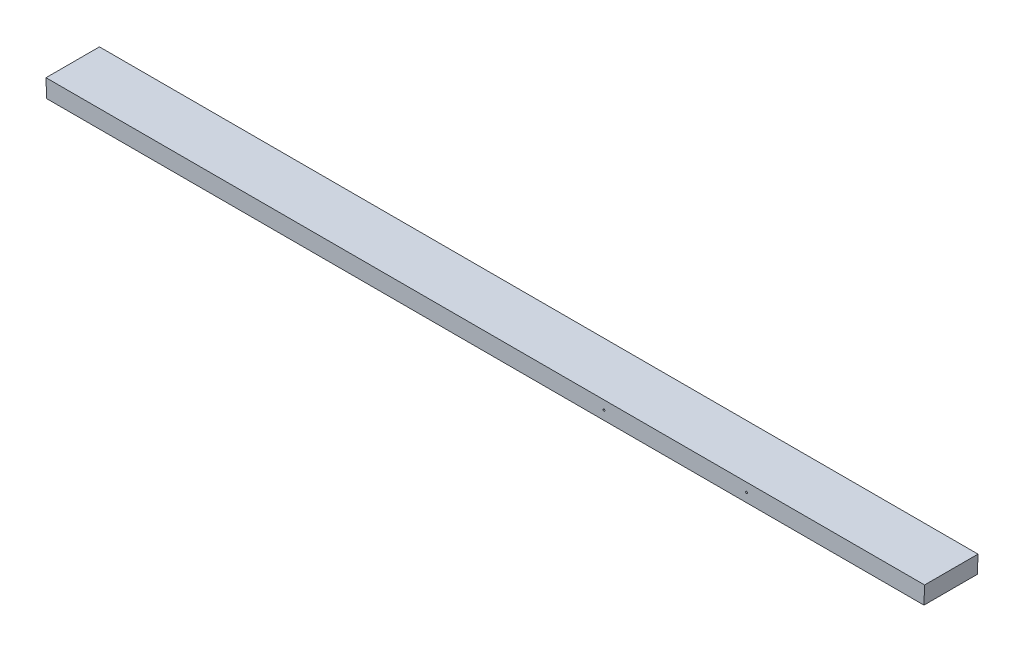
ISO-10303-21;
HEADER;
FILE_DESCRIPTION(('STEP AP214'),'2;1');
FILE_NAME('part.step','',(''),(''),'','','');
FILE_SCHEMA(('AUTOMOTIVE_DESIGN { 1 0 10303 214 1 1 1 1 }'));
ENDSEC;
DATA;
#1=APPLICATION_CONTEXT('core data for automotive mechanical design processes');
#2=APPLICATION_PROTOCOL_DEFINITION('international standard','automotive_design',2000,#1);
#3=PRODUCT_CONTEXT('',#1,'mechanical');
#4=PRODUCT('Part','Part','',(#3));
#5=PRODUCT_RELATED_PRODUCT_CATEGORY('part','',(#4));
#6=PRODUCT_DEFINITION_FORMATION('','',#4);
#7=PRODUCT_DEFINITION_CONTEXT('part definition',#1,'design');
#8=PRODUCT_DEFINITION('design','',#6,#7);
#9=PRODUCT_DEFINITION_SHAPE('','',#8);
#10=(LENGTH_UNIT() NAMED_UNIT(*) SI_UNIT(.MILLI.,.METRE.));
#11=(NAMED_UNIT(*) PLANE_ANGLE_UNIT() SI_UNIT($,.RADIAN.));
#12=(NAMED_UNIT(*) SI_UNIT($,.STERADIAN.) SOLID_ANGLE_UNIT());
#13=UNCERTAINTY_MEASURE_WITH_UNIT(LENGTH_MEASURE(1.E-05),#10,'distance_accuracy_value','');
#14=(GEOMETRIC_REPRESENTATION_CONTEXT(3) GLOBAL_UNCERTAINTY_ASSIGNED_CONTEXT((#13)) GLOBAL_UNIT_ASSIGNED_CONTEXT((#10,
#11,#12)) REPRESENTATION_CONTEXT('',''));
#15=CARTESIAN_POINT('',(0.,0.,0.));
#16=DIRECTION('',(0.,0.,1.));
#17=DIRECTION('',(1.,0.,0.));
#18=AXIS2_PLACEMENT_3D('',#15,#16,#17);
#19=CARTESIAN_POINT('',(-469.231738923997,5916.9300001442,2683.51));
#20=DIRECTION('',(0.,-1.,0.));
#21=DIRECTION('',(0.,0.,-1.));
#22=AXIS2_PLACEMENT_3D('',#19,#20,#21);
#23=PLANE('',#22);
#24=DIRECTION('',(1.,0.,0.));
#25=VECTOR('',#24,1.);
#26=CARTESIAN_POINT('',(2.98372437868011E-13,5916.9300001442,2683.51));
#27=LINE('',#26,#25);
#28=CARTESIAN_POINT('',(-469.231738923997,5916.9300001442,2683.51));
#29=VERTEX_POINT('',#28);
#30=CARTESIAN_POINT('',(469.231738923998,5916.9300001442,2683.51));
#31=VERTEX_POINT('',#30);
#32=EDGE_CURVE('E171',#29,#31,#27,.T.);
#33=ORIENTED_EDGE('',*,*,#32,.T.);
#34=DIRECTION('',(0.,0.,1.));
#35=VECTOR('',#34,1.);
#36=CARTESIAN_POINT('',(469.231738923998,5916.9300001442,2683.51));
#37=LINE('',#36,#35);
#38=CARTESIAN_POINT('',(469.231738923998,5916.9300001442,2740.66));
#39=VERTEX_POINT('',#38);
#40=EDGE_CURVE('E93',#39,#31,#37,.F.);
#41=ORIENTED_EDGE('',*,*,#40,.F.);
#42=DIRECTION('',(-1.,0.,0.));
#43=VECTOR('',#42,1.);
#44=CARTESIAN_POINT('',(-1.08246744900953E-12,5916.9300001442,2740.66));
#45=LINE('',#44,#43);
#46=CARTESIAN_POINT('',(-469.231738923997,5916.9300001442,2740.66));
#47=VERTEX_POINT('',#46);
#48=EDGE_CURVE('E98',#39,#47,#45,.T.);
#49=ORIENTED_EDGE('',*,*,#48,.T.);
#50=DIRECTION('',(0.,0.,1.));
#51=VECTOR('',#50,1.);
#52=CARTESIAN_POINT('',(-469.231738923999,5916.9300001442,2683.51));
#53=LINE('',#52,#51);
#54=EDGE_CURVE('E164',#29,#47,#53,.T.);
#55=ORIENTED_EDGE('',*,*,#54,.F.);
#56=EDGE_LOOP('',(#33,#41,#49,#55));
#57=FACE_BOUND('',#56,.T.);
#58=ADVANCED_FACE('F52',(#57),#23,.T.);
#59=CARTESIAN_POINT('',(0.,5926.4550001442,2740.66));
#60=DIRECTION('',(0.,0.,-1.));
#61=DIRECTION('',(-1.,0.,0.));
#62=AXIS2_PLACEMENT_3D('',#59,#60,#61);
#63=PLANE('',#62);
#64=CARTESIAN_POINT('',(127.000000000001,5926.4550001442,2740.66));
#65=DIRECTION('',(0.,0.,-1.));
#66=DIRECTION('',(-1.,0.,0.));
#67=AXIS2_PLACEMENT_3D('',#64,#65,#66);
#68=CIRCLE('',#67,0.991870000000006);
#69=CARTESIAN_POINT('',(126.008130000001,5926.4550001442,2740.66));
#70=VERTEX_POINT('',#69);
#71=EDGE_CURVE('E55',#70,#70,#68,.T.);
#72=ORIENTED_EDGE('',*,*,#71,.T.);
#73=EDGE_LOOP('',(#72));
#74=FACE_BOUND('',#73,.T.);
#75=CARTESIAN_POINT('',(279.400000000001,5926.4550001442,2740.66));
#76=DIRECTION('',(0.,0.,-1.));
#77=DIRECTION('',(-1.,0.,0.));
#78=AXIS2_PLACEMENT_3D('',#75,#76,#77);
#79=CIRCLE('',#78,0.991870000000006);
#80=CARTESIAN_POINT('',(278.408130000001,5926.4550001442,2740.66));
#81=VERTEX_POINT('',#80);
#82=EDGE_CURVE('E135',#81,#81,#79,.T.);
#83=ORIENTED_EDGE('',*,*,#82,.T.);
#84=EDGE_LOOP('',(#83));
#85=FACE_BOUND('',#84,.T.);
#86=ORIENTED_EDGE('',*,*,#48,.F.);
#87=DIRECTION('',(0.0340355254361648,0.999420623665675,0.));
#88=VECTOR('',#87,1.);
#89=CARTESIAN_POINT('',(469.231738923998,5916.9300001442,2740.66));
#90=LINE('',#89,#88);
#91=CARTESIAN_POINT('',(469.880491555479,5935.9800001442,2740.66));
#92=VERTEX_POINT('',#91);
#93=EDGE_CURVE('E176',#92,#39,#90,.F.);
#94=ORIENTED_EDGE('',*,*,#93,.F.);
#95=DIRECTION('',(1.,0.,0.));
#96=VECTOR('',#95,1.);
#97=CARTESIAN_POINT('',(469.88049155548,5935.9800001442,2740.66));
#98=LINE('',#97,#96);
#99=CARTESIAN_POINT('',(-469.880491555479,5935.9800001442,2740.66));
#100=VERTEX_POINT('',#99);
#101=EDGE_CURVE('E161',#100,#92,#98,.T.);
#102=ORIENTED_EDGE('',*,*,#101,.F.);
#103=DIRECTION('',(0.0340355254361643,-0.999420623665674,0.));
#104=VECTOR('',#103,1.);
#105=CARTESIAN_POINT('',(-469.880491555478,5935.9800001442,2740.66));
#106=LINE('',#105,#104);
#107=EDGE_CURVE('E168',#47,#100,#106,.F.);
#108=ORIENTED_EDGE('',*,*,#107,.F.);
#109=EDGE_LOOP('',(#86,#94,#102,#108));
#110=FACE_BOUND('',#109,.T.);
#111=ADVANCED_FACE('F191',(#74,#85,#110),#63,.F.);
#112=CARTESIAN_POINT('',(469.231738923998,5916.9300001442,2683.51));
#113=DIRECTION('',(0.999420623665674,-0.0340355254361645,0.));
#114=DIRECTION('',(0.0340355254361648,0.999420623665675,0.));
#115=AXIS2_PLACEMENT_3D('',#112,#113,#114);
#116=PLANE('',#115);
#117=DIRECTION('',(0.0340355254362029,0.999420623665673,0.));
#118=VECTOR('',#117,1.);
#119=CARTESIAN_POINT('',(469.231738923998,5916.9300001442,2683.51));
#120=LINE('',#119,#118);
#121=CARTESIAN_POINT('',(469.880491555479,5935.9800001442,2683.51));
#122=VERTEX_POINT('',#121);
#123=EDGE_CURVE('E173',#31,#122,#120,.T.);
#124=ORIENTED_EDGE('',*,*,#123,.T.);
#125=DIRECTION('',(0.,0.,1.));
#126=VECTOR('',#125,1.);
#127=CARTESIAN_POINT('',(469.880491555479,5935.9800001442,2683.51));
#128=LINE('',#127,#126);
#129=EDGE_CURVE('E158',#92,#122,#128,.F.);
#130=ORIENTED_EDGE('',*,*,#129,.F.);
#131=ORIENTED_EDGE('',*,*,#93,.T.);
#132=ORIENTED_EDGE('',*,*,#40,.T.);
#133=EDGE_LOOP('',(#124,#130,#131,#132));
#134=FACE_BOUND('',#133,.T.);
#135=ADVANCED_FACE('F229',(#134),#116,.T.);
#136=CARTESIAN_POINT('',(5.13478148889135E-13,5565.14000007212,2683.51));
#137=DIRECTION('',(0.,0.,1.));
#138=DIRECTION('',(1.,0.,0.));
#139=AXIS2_PLACEMENT_3D('',#136,#137,#138);
#140=PLANE('',#139);
#141=CARTESIAN_POINT('',(5.06539254985228E-13,5926.4550001442,2683.51));
#142=DIRECTION('',(0.,0.,1.));
#143=DIRECTION('',(1.,0.,0.));
#144=AXIS2_PLACEMENT_3D('',#141,#142,#143);
#145=CIRCLE('',#144,0.991870000000001);
#146=CARTESIAN_POINT('',(0.991870000000508,5926.4550001442,2683.51));
#147=VERTEX_POINT('',#146);
#148=EDGE_CURVE('E139',#147,#147,#145,.T.);
#149=ORIENTED_EDGE('',*,*,#148,.T.);
#150=EDGE_LOOP('',(#149));
#151=FACE_BOUND('',#150,.T.);
#152=CARTESIAN_POINT('',(203.200000000001,5926.4550001442,2683.51));
#153=DIRECTION('',(0.,0.,1.));
#154=DIRECTION('',(1.,0.,0.));
#155=AXIS2_PLACEMENT_3D('',#152,#153,#154);
#156=CIRCLE('',#155,0.991870000000006);
#157=CARTESIAN_POINT('',(204.191870000001,5926.4550001442,2683.51));
#158=VERTEX_POINT('',#157);
#159=EDGE_CURVE('E143',#158,#158,#156,.T.);
#160=ORIENTED_EDGE('',*,*,#159,.T.);
#161=EDGE_LOOP('',(#160));
#162=FACE_BOUND('',#161,.T.);
#163=CARTESIAN_POINT('',(406.400000000001,5926.4550001442,2683.51));
#164=DIRECTION('',(0.,0.,1.));
#165=DIRECTION('',(1.,0.,0.));
#166=AXIS2_PLACEMENT_3D('',#163,#164,#165);
#167=CIRCLE('',#166,0.991870000000006);
#168=CARTESIAN_POINT('',(407.391870000001,5926.4550001442,2683.51));
#169=VERTEX_POINT('',#168);
#170=EDGE_CURVE('E147',#169,#169,#167,.T.);
#171=ORIENTED_EDGE('',*,*,#170,.T.);
#172=EDGE_LOOP('',(#171));
#173=FACE_BOUND('',#172,.T.);
#174=CARTESIAN_POINT('',(-406.4,5926.4550001442,2683.51));
#175=DIRECTION('',(0.,0.,1.));
#176=DIRECTION('',(1.,0.,0.));
#177=AXIS2_PLACEMENT_3D('',#174,#175,#176);
#178=CIRCLE('',#177,0.991870000000006);
#179=CARTESIAN_POINT('',(-405.40813,5926.4550001442,2683.51));
#180=VERTEX_POINT('',#179);
#181=EDGE_CURVE('E151',#180,#180,#178,.T.);
#182=ORIENTED_EDGE('',*,*,#181,.T.);
#183=EDGE_LOOP('',(#182));
#184=FACE_BOUND('',#183,.T.);
#185=CARTESIAN_POINT('',(-203.199999999999,5926.4550001442,2683.51));
#186=DIRECTION('',(0.,0.,1.));
#187=DIRECTION('',(1.,0.,0.));
#188=AXIS2_PLACEMENT_3D('',#185,#186,#187);
#189=CIRCLE('',#188,0.991870000000006);
#190=CARTESIAN_POINT('',(-202.208129999999,5926.4550001442,2683.51));
#191=VERTEX_POINT('',#190);
#192=EDGE_CURVE('E154',#191,#191,#189,.T.);
#193=ORIENTED_EDGE('',*,*,#192,.T.);
#194=EDGE_LOOP('',(#193));
#195=FACE_BOUND('',#194,.T.);
#196=DIRECTION('',(0.0340355254361643,-0.999420623665674,0.));
#197=VECTOR('',#196,1.);
#198=CARTESIAN_POINT('',(-469.880491555478,5935.9800001442,2683.51));
#199=LINE('',#198,#197);
#200=CARTESIAN_POINT('',(-469.880491555478,5935.9800001442,2683.51));
#201=VERTEX_POINT('',#200);
#202=EDGE_CURVE('E70',#201,#29,#199,.T.);
#203=ORIENTED_EDGE('',*,*,#202,.F.);
#204=DIRECTION('',(1.,0.,0.));
#205=VECTOR('',#204,1.);
#206=CARTESIAN_POINT('',(469.880491555479,5935.9800001442,2683.51));
#207=LINE('',#206,#205);
#208=EDGE_CURVE('E61',#122,#201,#207,.F.);
#209=ORIENTED_EDGE('',*,*,#208,.F.);
#210=ORIENTED_EDGE('',*,*,#123,.F.);
#211=ORIENTED_EDGE('',*,*,#32,.F.);
#212=EDGE_LOOP('',(#203,#209,#210,#211));
#213=FACE_BOUND('',#212,.T.);
#214=ADVANCED_FACE('F222',(#151,#162,#173,#184,#195,#213),#140,.F.);
#215=CARTESIAN_POINT('',(-469.880491555478,5935.9800001442,2683.51));
#216=DIRECTION('',(-0.999420623665674,-0.0340355254361644,0.));
#217=DIRECTION('',(0.0340355254361643,-0.999420623665674,0.));
#218=AXIS2_PLACEMENT_3D('',#215,#216,#217);
#219=PLANE('',#218);
#220=ORIENTED_EDGE('',*,*,#202,.T.);
#221=ORIENTED_EDGE('',*,*,#54,.T.);
#222=ORIENTED_EDGE('',*,*,#107,.T.);
#223=DIRECTION('',(0.,0.,1.));
#224=VECTOR('',#223,1.);
#225=CARTESIAN_POINT('',(-469.880491555478,5935.9800001442,2683.51));
#226=LINE('',#225,#224);
#227=EDGE_CURVE('E13',#201,#100,#226,.T.);
#228=ORIENTED_EDGE('',*,*,#227,.F.);
#229=EDGE_LOOP('',(#220,#221,#222,#228));
#230=FACE_BOUND('',#229,.T.);
#231=ADVANCED_FACE('F212',(#230),#219,.T.);
#232=CARTESIAN_POINT('',(469.880491555479,5935.9800001442,2683.51));
#233=DIRECTION('',(0.,1.,0.));
#234=DIRECTION('',(0.,0.,1.));
#235=AXIS2_PLACEMENT_3D('',#232,#233,#234);
#236=PLANE('',#235);
#237=ORIENTED_EDGE('',*,*,#208,.T.);
#238=ORIENTED_EDGE('',*,*,#227,.T.);
#239=ORIENTED_EDGE('',*,*,#101,.T.);
#240=ORIENTED_EDGE('',*,*,#129,.T.);
#241=EDGE_LOOP('',(#237,#238,#239,#240));
#242=FACE_BOUND('',#241,.T.);
#243=ADVANCED_FACE('F209',(#242),#236,.T.);
#244=CARTESIAN_POINT('',(-203.199999999999,5926.4550001442,2664.46));
#245=DIRECTION('',(0.,0.,-1.));
#246=DIRECTION('',(-1.,0.,0.));
#247=AXIS2_PLACEMENT_3D('',#244,#245,#246);
#248=CYLINDRICAL_SURFACE('',#247,0.991870000000006);
#249=CARTESIAN_POINT('',(-203.199999999999,5926.4550001442,2696.21));
#250=DIRECTION('',(0.,0.,-1.));
#251=DIRECTION('',(-1.,0.,0.));
#252=AXIS2_PLACEMENT_3D('',#249,#250,#251);
#253=CIRCLE('',#252,0.991870000000006);
#254=CARTESIAN_POINT('',(-204.191869999999,5926.4550001442,2696.21));
#255=VERTEX_POINT('',#254);
#256=EDGE_CURVE('E152',#255,#255,#253,.T.);
#257=ORIENTED_EDGE('',*,*,#256,.F.);
#258=EDGE_LOOP('',(#257));
#259=FACE_BOUND('',#258,.T.);
#260=ORIENTED_EDGE('',*,*,#192,.F.);
#261=EDGE_LOOP('',(#260));
#262=FACE_BOUND('',#261,.T.);
#263=ADVANCED_FACE('F211',(#259,#262),#248,.F.);
#264=CARTESIAN_POINT('',(-203.199999999999,5926.4550001442,2696.21));
#265=DIRECTION('',(0.,0.,-1.));
#266=DIRECTION('',(-1.,0.,0.));
#267=AXIS2_PLACEMENT_3D('',#264,#265,#266);
#268=CONICAL_SURFACE('',#267,0.991870000000006,1.02974425867677);
#269=CARTESIAN_POINT('',(-203.199999999999,5926.4550001442,2696.8059756222));
#270=VERTEX_POINT('',#269);
#271=VERTEX_LOOP('',#270);
#272=FACE_BOUND('',#271,.T.);
#273=ORIENTED_EDGE('',*,*,#256,.T.);
#274=EDGE_LOOP('',(#273));
#275=FACE_BOUND('',#274,.T.);
#276=ADVANCED_FACE('F219',(#272,#275),#268,.F.);
#277=CARTESIAN_POINT('',(-406.4,5926.4550001442,2664.46));
#278=DIRECTION('',(0.,0.,-1.));
#279=DIRECTION('',(-1.,0.,0.));
#280=AXIS2_PLACEMENT_3D('',#277,#278,#279);
#281=CYLINDRICAL_SURFACE('',#280,0.991870000000006);
#282=CARTESIAN_POINT('',(-406.4,5926.4550001442,2696.21));
#283=DIRECTION('',(0.,0.,-1.));
#284=DIRECTION('',(-1.,0.,0.));
#285=AXIS2_PLACEMENT_3D('',#282,#283,#284);
#286=CIRCLE('',#285,0.991870000000006);
#287=CARTESIAN_POINT('',(-407.39187,5926.4550001442,2696.21));
#288=VERTEX_POINT('',#287);
#289=EDGE_CURVE('E148',#288,#288,#286,.T.);
#290=ORIENTED_EDGE('',*,*,#289,.F.);
#291=EDGE_LOOP('',(#290));
#292=FACE_BOUND('',#291,.T.);
#293=ORIENTED_EDGE('',*,*,#181,.F.);
#294=EDGE_LOOP('',(#293));
#295=FACE_BOUND('',#294,.T.);
#296=ADVANCED_FACE('F320',(#292,#295),#281,.F.);
#297=CARTESIAN_POINT('',(-406.4,5926.4550001442,2696.21));
#298=DIRECTION('',(0.,0.,-1.));
#299=DIRECTION('',(-1.,0.,0.));
#300=AXIS2_PLACEMENT_3D('',#297,#298,#299);
#301=CONICAL_SURFACE('',#300,0.991870000000006,1.02974425867677);
#302=CARTESIAN_POINT('',(-406.399999999999,5926.4550001442,2696.8059756222));
#303=VERTEX_POINT('',#302);
#304=VERTEX_LOOP('',#303);
#305=FACE_BOUND('',#304,.T.);
#306=ORIENTED_EDGE('',*,*,#289,.T.);
#307=EDGE_LOOP('',(#306));
#308=FACE_BOUND('',#307,.T.);
#309=ADVANCED_FACE('F311',(#305,#308),#301,.F.);
#310=CARTESIAN_POINT('',(406.400000000001,5926.4550001442,2664.46));
#311=DIRECTION('',(0.,0.,-1.));
#312=DIRECTION('',(-1.,0.,0.));
#313=AXIS2_PLACEMENT_3D('',#310,#311,#312);
#314=CYLINDRICAL_SURFACE('',#313,0.991870000000006);
#315=CARTESIAN_POINT('',(406.400000000001,5926.4550001442,2696.21));
#316=DIRECTION('',(0.,0.,-1.));
#317=DIRECTION('',(-1.,0.,0.));
#318=AXIS2_PLACEMENT_3D('',#315,#316,#317);
#319=CIRCLE('',#318,0.991870000000006);
#320=CARTESIAN_POINT('',(405.408130000001,5926.4550001442,2696.21));
#321=VERTEX_POINT('',#320);
#322=EDGE_CURVE('E144',#321,#321,#319,.T.);
#323=ORIENTED_EDGE('',*,*,#322,.F.);
#324=EDGE_LOOP('',(#323));
#325=FACE_BOUND('',#324,.T.);
#326=ORIENTED_EDGE('',*,*,#170,.F.);
#327=EDGE_LOOP('',(#326));
#328=FACE_BOUND('',#327,.T.);
#329=ADVANCED_FACE('F302',(#325,#328),#314,.F.);
#330=CARTESIAN_POINT('',(406.400000000001,5926.4550001442,2696.21));
#331=DIRECTION('',(0.,0.,-1.));
#332=DIRECTION('',(-1.,0.,0.));
#333=AXIS2_PLACEMENT_3D('',#330,#331,#332);
#334=CONICAL_SURFACE('',#333,0.991870000000006,1.02974425867677);
#335=CARTESIAN_POINT('',(406.400000000001,5926.4550001442,2696.8059756222));
#336=VERTEX_POINT('',#335);
#337=VERTEX_LOOP('',#336);
#338=FACE_BOUND('',#337,.T.);
#339=ORIENTED_EDGE('',*,*,#322,.T.);
#340=EDGE_LOOP('',(#339));
#341=FACE_BOUND('',#340,.T.);
#342=ADVANCED_FACE('F293',(#338,#341),#334,.F.);
#343=CARTESIAN_POINT('',(203.200000000001,5926.4550001442,2664.46));
#344=DIRECTION('',(0.,0.,-1.));
#345=DIRECTION('',(-1.,0.,0.));
#346=AXIS2_PLACEMENT_3D('',#343,#344,#345);
#347=CYLINDRICAL_SURFACE('',#346,0.991870000000006);
#348=CARTESIAN_POINT('',(203.200000000001,5926.4550001442,2696.21));
#349=DIRECTION('',(0.,0.,-1.));
#350=DIRECTION('',(-1.,0.,0.));
#351=AXIS2_PLACEMENT_3D('',#348,#349,#350);
#352=CIRCLE('',#351,0.991870000000006);
#353=CARTESIAN_POINT('',(202.208130000001,5926.4550001442,2696.21));
#354=VERTEX_POINT('',#353);
#355=EDGE_CURVE('E140',#354,#354,#352,.T.);
#356=ORIENTED_EDGE('',*,*,#355,.F.);
#357=EDGE_LOOP('',(#356));
#358=FACE_BOUND('',#357,.T.);
#359=ORIENTED_EDGE('',*,*,#159,.F.);
#360=EDGE_LOOP('',(#359));
#361=FACE_BOUND('',#360,.T.);
#362=ADVANCED_FACE('F284',(#358,#361),#347,.F.);
#363=CARTESIAN_POINT('',(203.200000000001,5926.4550001442,2696.21));
#364=DIRECTION('',(0.,0.,-1.));
#365=DIRECTION('',(-1.,0.,0.));
#366=AXIS2_PLACEMENT_3D('',#363,#364,#365);
#367=CONICAL_SURFACE('',#366,0.991870000000006,1.02974425867677);
#368=CARTESIAN_POINT('',(203.200000000001,5926.4550001442,2696.8059756222));
#369=VERTEX_POINT('',#368);
#370=VERTEX_LOOP('',#369);
#371=FACE_BOUND('',#370,.T.);
#372=ORIENTED_EDGE('',*,*,#355,.T.);
#373=EDGE_LOOP('',(#372));
#374=FACE_BOUND('',#373,.T.);
#375=ADVANCED_FACE('F275',(#371,#374),#367,.F.);
#376=CARTESIAN_POINT('',(3.81639164714898E-13,5926.4550001442,2664.46));
#377=DIRECTION('',(0.,0.,-1.));
#378=DIRECTION('',(-1.,0.,0.));
#379=AXIS2_PLACEMENT_3D('',#376,#377,#378);
#380=CYLINDRICAL_SURFACE('',#379,0.991870000000001);
#381=CARTESIAN_POINT('',(4.61436444609831E-13,5926.4550001442,2696.21));
#382=DIRECTION('',(0.,0.,-1.));
#383=DIRECTION('',(-1.,0.,0.));
#384=AXIS2_PLACEMENT_3D('',#381,#382,#383);
#385=CIRCLE('',#384,0.99187);
#386=CARTESIAN_POINT('',(-0.991869999999538,5926.4550001442,2696.21));
#387=VERTEX_POINT('',#386);
#388=EDGE_CURVE('E136',#387,#387,#385,.T.);
#389=ORIENTED_EDGE('',*,*,#388,.F.);
#390=EDGE_LOOP('',(#389));
#391=FACE_BOUND('',#390,.T.);
#392=ORIENTED_EDGE('',*,*,#148,.F.);
#393=EDGE_LOOP('',(#392));
#394=FACE_BOUND('',#393,.T.);
#395=ADVANCED_FACE('F205',(#391,#394),#380,.F.);
#396=CARTESIAN_POINT('',(4.61436444609831E-13,5926.4550001442,2696.21));
#397=DIRECTION('',(0.,0.,-1.));
#398=DIRECTION('',(-1.,0.,0.));
#399=AXIS2_PLACEMENT_3D('',#396,#397,#398);
#400=CONICAL_SURFACE('',#399,0.99187,1.02974425867677);
#401=CARTESIAN_POINT('',(4.33680868994202E-13,5926.4550001442,2696.8059756222));
#402=VERTEX_POINT('',#401);
#403=VERTEX_LOOP('',#402);
#404=FACE_BOUND('',#403,.T.);
#405=ORIENTED_EDGE('',*,*,#388,.T.);
#406=EDGE_LOOP('',(#405));
#407=FACE_BOUND('',#406,.T.);
#408=ADVANCED_FACE('F196',(#404,#407),#400,.F.);
#409=CARTESIAN_POINT('',(279.400000000002,5926.4550001442,2759.71000000001));
#410=DIRECTION('',(0.,0.,1.));
#411=DIRECTION('',(1.,0.,0.));
#412=AXIS2_PLACEMENT_3D('',#409,#410,#411);
#413=CYLINDRICAL_SURFACE('',#412,0.991870000000006);
#414=CARTESIAN_POINT('',(279.4,5926.4550001442,2721.61000000001));
#415=DIRECTION('',(0.,0.,1.));
#416=DIRECTION('',(1.,0.,0.));
#417=AXIS2_PLACEMENT_3D('',#414,#415,#416);
#418=CIRCLE('',#417,0.991870000000006);
#419=CARTESIAN_POINT('',(280.39187,5926.4550001442,2721.61000000001));
#420=VERTEX_POINT('',#419);
#421=EDGE_CURVE('E131',#420,#420,#418,.T.);
#422=ORIENTED_EDGE('',*,*,#421,.F.);
#423=EDGE_LOOP('',(#422));
#424=FACE_BOUND('',#423,.T.);
#425=ORIENTED_EDGE('',*,*,#82,.F.);
#426=EDGE_LOOP('',(#425));
#427=FACE_BOUND('',#426,.T.);
#428=ADVANCED_FACE('F193',(#424,#427),#413,.F.);
#429=CARTESIAN_POINT('',(279.4,5926.4550001442,2721.61000000001));
#430=DIRECTION('',(0.,0.,1.));
#431=DIRECTION('',(1.,0.,0.));
#432=AXIS2_PLACEMENT_3D('',#429,#430,#431);
#433=CONICAL_SURFACE('',#432,0.991870000000006,1.02974425867677);
#434=CARTESIAN_POINT('',(279.400000000002,5926.4550001442,2721.01402437781));
#435=VERTEX_POINT('',#434);
#436=VERTEX_LOOP('',#435);
#437=FACE_BOUND('',#436,.T.);
#438=ORIENTED_EDGE('',*,*,#421,.T.);
#439=EDGE_LOOP('',(#438));
#440=FACE_BOUND('',#439,.T.);
#441=ADVANCED_FACE('F195',(#437,#440),#433,.F.);
#442=CARTESIAN_POINT('',(127.000000000001,5926.4550001442,2759.71000000001));
#443=DIRECTION('',(0.,0.,1.));
#444=DIRECTION('',(1.,0.,0.));
#445=AXIS2_PLACEMENT_3D('',#442,#443,#444);
#446=CYLINDRICAL_SURFACE('',#445,0.991870000000006);
#447=CARTESIAN_POINT('',(127.000000000001,5926.4550001442,2721.61000000001));
#448=DIRECTION('',(0.,0.,1.));
#449=DIRECTION('',(1.,0.,0.));
#450=AXIS2_PLACEMENT_3D('',#447,#448,#449);
#451=CIRCLE('',#450,0.991870000000006);
#452=CARTESIAN_POINT('',(127.991870000001,5926.4550001442,2721.61000000001));
#453=VERTEX_POINT('',#452);
#454=EDGE_CURVE('E127',#453,#453,#451,.T.);
#455=ORIENTED_EDGE('',*,*,#454,.F.);
#456=EDGE_LOOP('',(#455));
#457=FACE_BOUND('',#456,.T.);
#458=ORIENTED_EDGE('',*,*,#71,.F.);
#459=EDGE_LOOP('',(#458));
#460=FACE_BOUND('',#459,.T.);
#461=ADVANCED_FACE('F123',(#457,#460),#446,.F.);
#462=CARTESIAN_POINT('',(127.000000000001,5926.4550001442,2721.61000000001));
#463=DIRECTION('',(0.,0.,1.));
#464=DIRECTION('',(1.,0.,0.));
#465=AXIS2_PLACEMENT_3D('',#462,#463,#464);
#466=CONICAL_SURFACE('',#465,0.991870000000006,1.02974425867677);
#467=CARTESIAN_POINT('',(127.,5926.4550001442,2721.01402437781));
#468=VERTEX_POINT('',#467);
#469=VERTEX_LOOP('',#468);
#470=FACE_BOUND('',#469,.T.);
#471=ORIENTED_EDGE('',*,*,#454,.T.);
#472=EDGE_LOOP('',(#471));
#473=FACE_BOUND('',#472,.T.);
#474=ADVANCED_FACE('F120',(#470,#473),#466,.F.);
#475=CLOSED_SHELL('',(#58,#111,#135,#214,#231,#243,#263,#276,#296,#309,#329,#342,#362,#375,#395,
#408,#428,#441,#461,#474));
#476=MANIFOLD_SOLID_BREP('B2',#475);
#477=ADVANCED_BREP_SHAPE_REPRESENTATION('',(#18,#476),#14);
#478=SHAPE_DEFINITION_REPRESENTATION(#9,#477);
ENDSEC;
END-ISO-10303-21;
